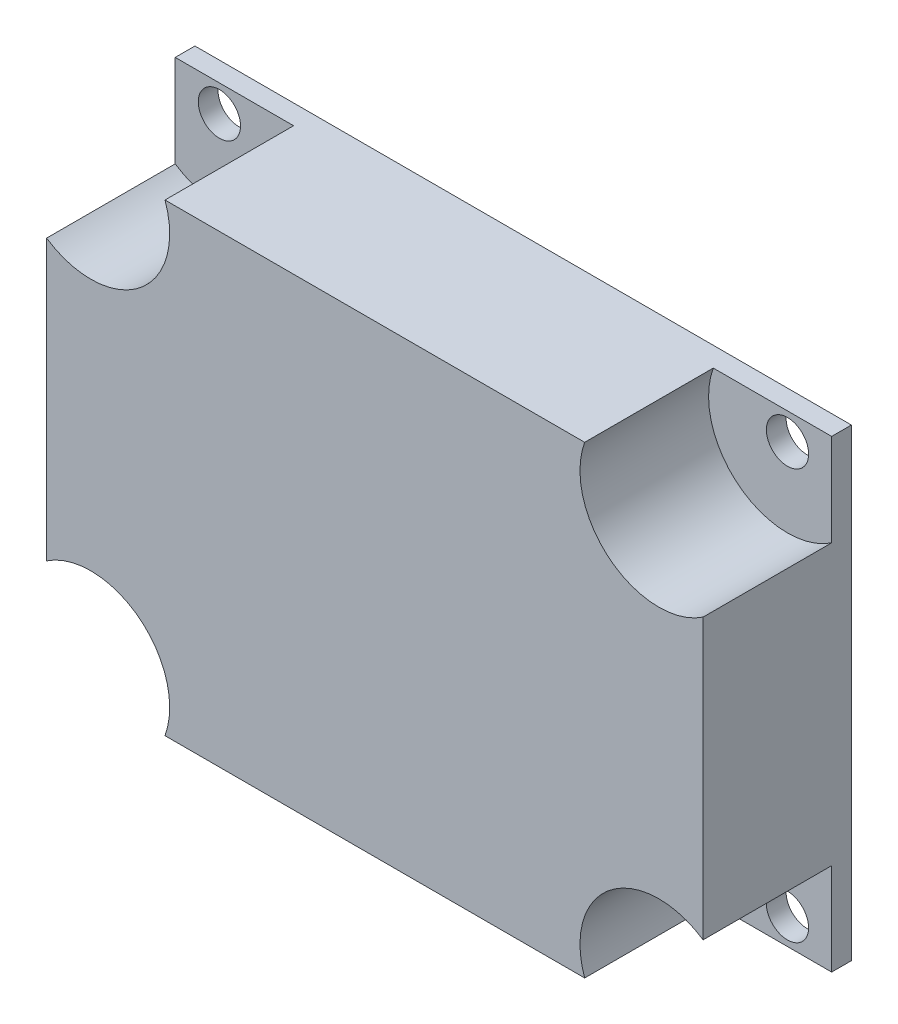
ISO-10303-21;
HEADER;
FILE_DESCRIPTION(('STEP AP214'),'2;1');
FILE_NAME('part.step','',(''),(''),'','','');
FILE_SCHEMA(('AUTOMOTIVE_DESIGN { 1 0 10303 214 1 1 1 1 }'));
ENDSEC;
DATA;
#1=APPLICATION_CONTEXT('core data for automotive mechanical design processes');
#2=APPLICATION_PROTOCOL_DEFINITION('international standard','automotive_design',2000,#1);
#3=PRODUCT_CONTEXT('',#1,'mechanical');
#4=PRODUCT('Part','Part','',(#3));
#5=PRODUCT_RELATED_PRODUCT_CATEGORY('part','',(#4));
#6=PRODUCT_DEFINITION_FORMATION('','',#4);
#7=PRODUCT_DEFINITION_CONTEXT('part definition',#1,'design');
#8=PRODUCT_DEFINITION('design','',#6,#7);
#9=PRODUCT_DEFINITION_SHAPE('','',#8);
#10=(LENGTH_UNIT() NAMED_UNIT(*) SI_UNIT(.MILLI.,.METRE.));
#11=(NAMED_UNIT(*) PLANE_ANGLE_UNIT() SI_UNIT($,.RADIAN.));
#12=(NAMED_UNIT(*) SI_UNIT($,.STERADIAN.) SOLID_ANGLE_UNIT());
#13=UNCERTAINTY_MEASURE_WITH_UNIT(LENGTH_MEASURE(1.E-05),#10,'distance_accuracy_value','');
#14=(GEOMETRIC_REPRESENTATION_CONTEXT(3) GLOBAL_UNCERTAINTY_ASSIGNED_CONTEXT((#13)) GLOBAL_UNIT_ASSIGNED_CONTEXT((#10,
#11,#12)) REPRESENTATION_CONTEXT('',''));
#15=CARTESIAN_POINT('',(0.,0.,0.));
#16=DIRECTION('',(0.,0.,1.));
#17=DIRECTION('',(1.,0.,0.));
#18=AXIS2_PLACEMENT_3D('',#15,#16,#17);
#19=CARTESIAN_POINT('',(-22.86,-16.51,11.938));
#20=DIRECTION('',(0.,0.,1.));
#21=DIRECTION('',(1.,0.,0.));
#22=AXIS2_PLACEMENT_3D('',#19,#20,#21);
#23=CYLINDRICAL_SURFACE('',#22,1.69999999999999);
#24=CARTESIAN_POINT('',(-22.86,-16.51,0.));
#25=DIRECTION('',(0.,0.,1.));
#26=DIRECTION('',(1.,0.,0.));
#27=AXIS2_PLACEMENT_3D('',#24,#25,#26);
#28=CIRCLE('',#27,1.69999999999999);
#29=CARTESIAN_POINT('',(-21.16,-16.51,0.));
#30=VERTEX_POINT('',#29);
#31=EDGE_CURVE('E166',#30,#30,#28,.T.);
#32=ORIENTED_EDGE('',*,*,#31,.F.);
#33=EDGE_LOOP('',(#32));
#34=FACE_BOUND('',#33,.T.);
#35=CARTESIAN_POINT('',(-22.86,-16.51,1.5875));
#36=DIRECTION('',(0.,0.,1.));
#37=DIRECTION('',(1.,0.,0.));
#38=AXIS2_PLACEMENT_3D('',#35,#36,#37);
#39=CIRCLE('',#38,1.69999999999999);
#40=CARTESIAN_POINT('',(-21.16,-16.51,1.5875));
#41=VERTEX_POINT('',#40);
#42=EDGE_CURVE('E39',#41,#41,#39,.F.);
#43=ORIENTED_EDGE('',*,*,#42,.F.);
#44=EDGE_LOOP('',(#43));
#45=FACE_BOUND('',#44,.T.);
#46=ADVANCED_FACE('F35',(#34,#45),#23,.F.);
#47=CARTESIAN_POINT('',(22.86,16.51,11.938));
#48=DIRECTION('',(0.,0.,1.));
#49=DIRECTION('',(1.,0.,0.));
#50=AXIS2_PLACEMENT_3D('',#47,#48,#49);
#51=CYLINDRICAL_SURFACE('',#50,1.69999999999999);
#52=CARTESIAN_POINT('',(22.86,16.51,0.));
#53=DIRECTION('',(0.,0.,1.));
#54=DIRECTION('',(1.,0.,0.));
#55=AXIS2_PLACEMENT_3D('',#52,#53,#54);
#56=CIRCLE('',#55,1.69999999999999);
#57=CARTESIAN_POINT('',(24.56,16.51,0.));
#58=VERTEX_POINT('',#57);
#59=EDGE_CURVE('E227',#58,#58,#56,.T.);
#60=ORIENTED_EDGE('',*,*,#59,.F.);
#61=EDGE_LOOP('',(#60));
#62=FACE_BOUND('',#61,.T.);
#63=CARTESIAN_POINT('',(22.86,16.51,1.5875));
#64=DIRECTION('',(0.,0.,1.));
#65=DIRECTION('',(1.,0.,0.));
#66=AXIS2_PLACEMENT_3D('',#63,#64,#65);
#67=CIRCLE('',#66,1.69999999999999);
#68=CARTESIAN_POINT('',(24.56,16.51,1.5875));
#69=VERTEX_POINT('',#68);
#70=EDGE_CURVE('E185',#69,#69,#67,.F.);
#71=ORIENTED_EDGE('',*,*,#70,.F.);
#72=EDGE_LOOP('',(#71));
#73=FACE_BOUND('',#72,.T.);
#74=ADVANCED_FACE('F237',(#62,#73),#51,.F.);
#75=CARTESIAN_POINT('',(22.86,-16.51,11.938));
#76=DIRECTION('',(0.,0.,1.));
#77=DIRECTION('',(1.,0.,0.));
#78=AXIS2_PLACEMENT_3D('',#75,#76,#77);
#79=CYLINDRICAL_SURFACE('',#78,1.69999999999999);
#80=CARTESIAN_POINT('',(22.86,-16.51,0.));
#81=DIRECTION('',(0.,0.,1.));
#82=DIRECTION('',(1.,0.,0.));
#83=AXIS2_PLACEMENT_3D('',#80,#81,#82);
#84=CIRCLE('',#83,1.69999999999999);
#85=CARTESIAN_POINT('',(24.56,-16.51,0.));
#86=VERTEX_POINT('',#85);
#87=EDGE_CURVE('E224',#86,#86,#84,.T.);
#88=ORIENTED_EDGE('',*,*,#87,.F.);
#89=EDGE_LOOP('',(#88));
#90=FACE_BOUND('',#89,.T.);
#91=CARTESIAN_POINT('',(22.86,-16.51,1.5875));
#92=DIRECTION('',(0.,0.,1.));
#93=DIRECTION('',(1.,0.,0.));
#94=AXIS2_PLACEMENT_3D('',#91,#92,#93);
#95=CIRCLE('',#94,1.69999999999999);
#96=CARTESIAN_POINT('',(24.56,-16.51,1.5875));
#97=VERTEX_POINT('',#96);
#98=EDGE_CURVE('E182',#97,#97,#95,.F.);
#99=ORIENTED_EDGE('',*,*,#98,.F.);
#100=EDGE_LOOP('',(#99));
#101=FACE_BOUND('',#100,.T.);
#102=ADVANCED_FACE('F311',(#90,#101),#79,.F.);
#103=CARTESIAN_POINT('',(-22.86,16.51,11.938));
#104=DIRECTION('',(0.,0.,1.));
#105=DIRECTION('',(1.,0.,0.));
#106=AXIS2_PLACEMENT_3D('',#103,#104,#105);
#107=CYLINDRICAL_SURFACE('',#106,1.69999999999999);
#108=CARTESIAN_POINT('',(-22.86,16.51,0.));
#109=DIRECTION('',(0.,0.,1.));
#110=DIRECTION('',(1.,0.,0.));
#111=AXIS2_PLACEMENT_3D('',#108,#109,#110);
#112=CIRCLE('',#111,1.69999999999999);
#113=CARTESIAN_POINT('',(-21.16,16.51,0.));
#114=VERTEX_POINT('',#113);
#115=EDGE_CURVE('E221',#114,#114,#112,.T.);
#116=ORIENTED_EDGE('',*,*,#115,.F.);
#117=EDGE_LOOP('',(#116));
#118=FACE_BOUND('',#117,.T.);
#119=CARTESIAN_POINT('',(-22.86,16.51,1.5875));
#120=DIRECTION('',(0.,0.,1.));
#121=DIRECTION('',(1.,0.,0.));
#122=AXIS2_PLACEMENT_3D('',#119,#120,#121);
#123=CIRCLE('',#122,1.69999999999999);
#124=CARTESIAN_POINT('',(-21.16,16.51,1.5875));
#125=VERTEX_POINT('',#124);
#126=EDGE_CURVE('E178',#125,#125,#123,.F.);
#127=ORIENTED_EDGE('',*,*,#126,.F.);
#128=EDGE_LOOP('',(#127));
#129=FACE_BOUND('',#128,.T.);
#130=ADVANCED_FACE('F308',(#118,#129),#107,.F.);
#131=CARTESIAN_POINT('',(26.416,18.669,11.938));
#132=DIRECTION('',(-1.,0.,0.));
#133=DIRECTION('',(0.,-1.,0.));
#134=AXIS2_PLACEMENT_3D('',#131,#132,#133);
#135=PLANE('',#134);
#136=DIRECTION('',(0.,1.,0.));
#137=VECTOR('',#136,1.);
#138=CARTESIAN_POINT('',(26.416,18.669,1.5875));
#139=LINE('',#138,#137);
#140=CARTESIAN_POINT('',(26.416,11.2490719449892,1.5875));
#141=VERTEX_POINT('',#140);
#142=CARTESIAN_POINT('',(26.416,18.669,1.5875));
#143=VERTEX_POINT('',#142);
#144=EDGE_CURVE('E191',#141,#143,#139,.T.);
#145=ORIENTED_EDGE('',*,*,#144,.F.);
#146=DIRECTION('',(0.,0.,1.));
#147=VECTOR('',#146,1.);
#148=CARTESIAN_POINT('',(26.416,11.2490719449892,1.5875));
#149=LINE('',#148,#147);
#150=CARTESIAN_POINT('',(26.416,11.2490719449892,11.938));
#151=VERTEX_POINT('',#150);
#152=EDGE_CURVE('E214',#141,#151,#149,.T.);
#153=ORIENTED_EDGE('',*,*,#152,.T.);
#154=DIRECTION('',(0.,1.,0.));
#155=VECTOR('',#154,1.);
#156=CARTESIAN_POINT('',(26.416,18.669,11.938));
#157=LINE('',#156,#155);
#158=CARTESIAN_POINT('',(26.416,-11.2490719449892,11.938));
#159=VERTEX_POINT('',#158);
#160=EDGE_CURVE('E151',#159,#151,#157,.T.);
#161=ORIENTED_EDGE('',*,*,#160,.F.);
#162=DIRECTION('',(0.,0.,1.));
#163=VECTOR('',#162,1.);
#164=CARTESIAN_POINT('',(26.416,-11.2490719449892,1.5875));
#165=LINE('',#164,#163);
#166=CARTESIAN_POINT('',(26.416,-11.2490719449892,1.5875));
#167=VERTEX_POINT('',#166);
#168=EDGE_CURVE('E209',#159,#167,#165,.F.);
#169=ORIENTED_EDGE('',*,*,#168,.T.);
#170=DIRECTION('',(0.,1.,0.));
#171=VECTOR('',#170,1.);
#172=CARTESIAN_POINT('',(26.416,18.669,1.5875));
#173=LINE('',#172,#171);
#174=CARTESIAN_POINT('',(26.416,-18.669,1.5875));
#175=VERTEX_POINT('',#174);
#176=EDGE_CURVE('E188',#175,#167,#173,.T.);
#177=ORIENTED_EDGE('',*,*,#176,.F.);
#178=DIRECTION('',(0.,0.,-1.));
#179=VECTOR('',#178,1.);
#180=CARTESIAN_POINT('',(26.416,-18.669,11.938));
#181=LINE('',#180,#179);
#182=CARTESIAN_POINT('',(26.416,-18.669,0.));
#183=VERTEX_POINT('',#182);
#184=EDGE_CURVE('E161',#175,#183,#181,.T.);
#185=ORIENTED_EDGE('',*,*,#184,.T.);
#186=DIRECTION('',(0.,1.,0.));
#187=VECTOR('',#186,1.);
#188=CARTESIAN_POINT('',(26.416,18.669,0.));
#189=LINE('',#188,#187);
#190=CARTESIAN_POINT('',(26.416,18.669,0.));
#191=VERTEX_POINT('',#190);
#192=EDGE_CURVE('E162',#183,#191,#189,.T.);
#193=ORIENTED_EDGE('',*,*,#192,.T.);
#194=DIRECTION('',(0.,0.,-1.));
#195=VECTOR('',#194,1.);
#196=CARTESIAN_POINT('',(26.416,18.669,11.938));
#197=LINE('',#196,#195);
#198=EDGE_CURVE('E11',#143,#191,#197,.T.);
#199=ORIENTED_EDGE('',*,*,#198,.F.);
#200=EDGE_LOOP('',(#145,#153,#161,#169,#177,#185,#193,#199));
#201=FACE_BOUND('',#200,.T.);
#202=ADVANCED_FACE('F37',(#201),#135,.F.);
#203=CARTESIAN_POINT('',(-26.416,18.669,11.938));
#204=DIRECTION('',(0.,-1.,0.));
#205=DIRECTION('',(0.,0.,-1.));
#206=AXIS2_PLACEMENT_3D('',#203,#204,#205);
#207=PLANE('',#206);
#208=DIRECTION('',(-1.,0.,0.));
#209=VECTOR('',#208,1.);
#210=CARTESIAN_POINT('',(-26.416,18.669,11.938));
#211=LINE('',#210,#209);
#212=CARTESIAN_POINT('',(16.8882984836815,18.669,11.938));
#213=VERTEX_POINT('',#212);
#214=CARTESIAN_POINT('',(-16.8882984836816,18.669,11.938));
#215=VERTEX_POINT('',#214);
#216=EDGE_CURVE('E141',#213,#215,#211,.T.);
#217=ORIENTED_EDGE('',*,*,#216,.F.);
#218=DIRECTION('',(0.,0.,1.));
#219=VECTOR('',#218,1.);
#220=CARTESIAN_POINT('',(16.8882984836815,18.669,1.5875));
#221=LINE('',#220,#219);
#222=CARTESIAN_POINT('',(16.8882984836815,18.669,1.5875));
#223=VERTEX_POINT('',#222);
#224=EDGE_CURVE('E212',#213,#223,#221,.F.);
#225=ORIENTED_EDGE('',*,*,#224,.T.);
#226=DIRECTION('',(-1.,0.,0.));
#227=VECTOR('',#226,1.);
#228=CARTESIAN_POINT('',(-26.416,18.669,1.5875));
#229=LINE('',#228,#227);
#230=EDGE_CURVE('E187',#143,#223,#229,.T.);
#231=ORIENTED_EDGE('',*,*,#230,.F.);
#232=ORIENTED_EDGE('',*,*,#198,.T.);
#233=DIRECTION('',(-1.,0.,0.));
#234=VECTOR('',#233,1.);
#235=CARTESIAN_POINT('',(-26.416,18.669,0.));
#236=LINE('',#235,#234);
#237=CARTESIAN_POINT('',(-26.416,18.669,0.));
#238=VERTEX_POINT('',#237);
#239=EDGE_CURVE('E165',#191,#238,#236,.T.);
#240=ORIENTED_EDGE('',*,*,#239,.T.);
#241=DIRECTION('',(0.,0.,-1.));
#242=VECTOR('',#241,1.);
#243=CARTESIAN_POINT('',(-26.416,18.669,11.938));
#244=LINE('',#243,#242);
#245=CARTESIAN_POINT('',(-26.416,18.669,1.5875));
#246=VERTEX_POINT('',#245);
#247=EDGE_CURVE('E44',#246,#238,#244,.T.);
#248=ORIENTED_EDGE('',*,*,#247,.F.);
#249=DIRECTION('',(-1.,0.,0.));
#250=VECTOR('',#249,1.);
#251=CARTESIAN_POINT('',(-26.416,18.669,1.5875));
#252=LINE('',#251,#250);
#253=CARTESIAN_POINT('',(-16.8882984836816,18.669,1.5875));
#254=VERTEX_POINT('',#253);
#255=EDGE_CURVE('E143',#254,#246,#252,.T.);
#256=ORIENTED_EDGE('',*,*,#255,.F.);
#257=DIRECTION('',(0.,0.,1.));
#258=VECTOR('',#257,1.);
#259=CARTESIAN_POINT('',(-16.8882984836816,18.669,1.5875));
#260=LINE('',#259,#258);
#261=EDGE_CURVE('E127',#254,#215,#260,.T.);
#262=ORIENTED_EDGE('',*,*,#261,.T.);
#263=EDGE_LOOP('',(#217,#225,#231,#232,#240,#248,#256,#262));
#264=FACE_BOUND('',#263,.T.);
#265=ADVANCED_FACE('F139',(#264),#207,.F.);
#266=CARTESIAN_POINT('',(-26.416,18.669,11.938));
#267=DIRECTION('',(1.,0.,0.));
#268=DIRECTION('',(0.,0.,-1.));
#269=AXIS2_PLACEMENT_3D('',#266,#267,#268);
#270=PLANE('',#269);
#271=DIRECTION('',(0.,-1.,0.));
#272=VECTOR('',#271,1.);
#273=CARTESIAN_POINT('',(-26.416,18.669,1.5875));
#274=LINE('',#273,#272);
#275=CARTESIAN_POINT('',(-26.416,-11.2490719449892,1.5875));
#276=VERTEX_POINT('',#275);
#277=CARTESIAN_POINT('',(-26.416,-18.669,1.5875));
#278=VERTEX_POINT('',#277);
#279=EDGE_CURVE('E204',#276,#278,#274,.T.);
#280=ORIENTED_EDGE('',*,*,#279,.F.);
#281=DIRECTION('',(0.,0.,1.));
#282=VECTOR('',#281,1.);
#283=CARTESIAN_POINT('',(-26.416,-11.2490719449892,1.5875));
#284=LINE('',#283,#282);
#285=CARTESIAN_POINT('',(-26.416,-11.2490719449892,11.938));
#286=VERTEX_POINT('',#285);
#287=EDGE_CURVE('E218',#276,#286,#284,.T.);
#288=ORIENTED_EDGE('',*,*,#287,.T.);
#289=DIRECTION('',(0.,-1.,0.));
#290=VECTOR('',#289,1.);
#291=CARTESIAN_POINT('',(-26.416,18.669,11.938));
#292=LINE('',#291,#290);
#293=CARTESIAN_POINT('',(-26.416,11.2490719449892,11.938));
#294=VERTEX_POINT('',#293);
#295=EDGE_CURVE('E150',#294,#286,#292,.T.);
#296=ORIENTED_EDGE('',*,*,#295,.F.);
#297=DIRECTION('',(0.,0.,1.));
#298=VECTOR('',#297,1.);
#299=CARTESIAN_POINT('',(-26.416,11.2490719449892,1.5875));
#300=LINE('',#299,#298);
#301=CARTESIAN_POINT('',(-26.416,11.2490719449892,1.5875));
#302=VERTEX_POINT('',#301);
#303=EDGE_CURVE('E60',#294,#302,#300,.F.);
#304=ORIENTED_EDGE('',*,*,#303,.T.);
#305=DIRECTION('',(0.,-1.,0.));
#306=VECTOR('',#305,1.);
#307=CARTESIAN_POINT('',(-26.416,18.669,1.5875));
#308=LINE('',#307,#306);
#309=EDGE_CURVE('E181',#246,#302,#308,.T.);
#310=ORIENTED_EDGE('',*,*,#309,.F.);
#311=ORIENTED_EDGE('',*,*,#247,.T.);
#312=DIRECTION('',(0.,-1.,0.));
#313=VECTOR('',#312,1.);
#314=CARTESIAN_POINT('',(-26.416,18.669,0.));
#315=LINE('',#314,#313);
#316=CARTESIAN_POINT('',(-26.416,-18.669,0.));
#317=VERTEX_POINT('',#316);
#318=EDGE_CURVE('E169',#238,#317,#315,.T.);
#319=ORIENTED_EDGE('',*,*,#318,.T.);
#320=DIRECTION('',(0.,0.,-1.));
#321=VECTOR('',#320,1.);
#322=CARTESIAN_POINT('',(-26.416,-18.669,11.938));
#323=LINE('',#322,#321);
#324=EDGE_CURVE('E175',#278,#317,#323,.T.);
#325=ORIENTED_EDGE('',*,*,#324,.F.);
#326=EDGE_LOOP('',(#280,#288,#296,#304,#310,#311,#319,#325));
#327=FACE_BOUND('',#326,.T.);
#328=ADVANCED_FACE('F255',(#327),#270,.F.);
#329=CARTESIAN_POINT('',(-26.416,-18.669,11.938));
#330=DIRECTION('',(0.,1.,0.));
#331=DIRECTION('',(0.,0.,1.));
#332=AXIS2_PLACEMENT_3D('',#329,#330,#331);
#333=PLANE('',#332);
#334=DIRECTION('',(1.,0.,0.));
#335=VECTOR('',#334,1.);
#336=CARTESIAN_POINT('',(-26.416,-18.669,11.938));
#337=LINE('',#336,#335);
#338=CARTESIAN_POINT('',(-16.8882984836816,-18.669,11.938));
#339=VERTEX_POINT('',#338);
#340=CARTESIAN_POINT('',(16.8882984836815,-18.669,11.938));
#341=VERTEX_POINT('',#340);
#342=EDGE_CURVE('E153',#339,#341,#337,.T.);
#343=ORIENTED_EDGE('',*,*,#342,.F.);
#344=DIRECTION('',(0.,0.,1.));
#345=VECTOR('',#344,1.);
#346=CARTESIAN_POINT('',(-16.8882984836816,-18.669,1.5875));
#347=LINE('',#346,#345);
#348=CARTESIAN_POINT('',(-16.8882984836816,-18.669,1.5875));
#349=VERTEX_POINT('',#348);
#350=EDGE_CURVE('E52',#339,#349,#347,.F.);
#351=ORIENTED_EDGE('',*,*,#350,.T.);
#352=DIRECTION('',(1.,0.,0.));
#353=VECTOR('',#352,1.);
#354=CARTESIAN_POINT('',(-26.416,-18.669,1.5875));
#355=LINE('',#354,#353);
#356=EDGE_CURVE('E202',#278,#349,#355,.T.);
#357=ORIENTED_EDGE('',*,*,#356,.F.);
#358=ORIENTED_EDGE('',*,*,#324,.T.);
#359=DIRECTION('',(1.,0.,0.));
#360=VECTOR('',#359,1.);
#361=CARTESIAN_POINT('',(-26.416,-18.669,0.));
#362=LINE('',#361,#360);
#363=EDGE_CURVE('E155',#317,#183,#362,.T.);
#364=ORIENTED_EDGE('',*,*,#363,.T.);
#365=ORIENTED_EDGE('',*,*,#184,.F.);
#366=DIRECTION('',(1.,0.,0.));
#367=VECTOR('',#366,1.);
#368=CARTESIAN_POINT('',(-26.416,-18.669,1.5875));
#369=LINE('',#368,#367);
#370=CARTESIAN_POINT('',(16.8882984836815,-18.669,1.5875));
#371=VERTEX_POINT('',#370);
#372=EDGE_CURVE('E184',#371,#175,#369,.T.);
#373=ORIENTED_EDGE('',*,*,#372,.F.);
#374=DIRECTION('',(0.,0.,1.));
#375=VECTOR('',#374,1.);
#376=CARTESIAN_POINT('',(16.8882984836815,-18.669,1.5875));
#377=LINE('',#376,#375);
#378=EDGE_CURVE('E144',#371,#341,#377,.T.);
#379=ORIENTED_EDGE('',*,*,#378,.T.);
#380=EDGE_LOOP('',(#343,#351,#357,#358,#364,#365,#373,#379));
#381=FACE_BOUND('',#380,.T.);
#382=ADVANCED_FACE('F254',(#381),#333,.F.);
#383=CARTESIAN_POINT('',(0.,0.,11.938));
#384=DIRECTION('',(0.,0.,1.));
#385=DIRECTION('',(1.,0.,0.));
#386=AXIS2_PLACEMENT_3D('',#383,#384,#385);
#387=PLANE('',#386);
#388=CARTESIAN_POINT('',(-22.86,-16.51,11.938));
#389=DIRECTION('',(0.,0.,1.));
#390=DIRECTION('',(1.,0.,0.));
#391=AXIS2_PLACEMENT_3D('',#388,#389,#390);
#392=CIRCLE('',#391,6.35);
#393=EDGE_CURVE('E276',#339,#286,#392,.T.);
#394=ORIENTED_EDGE('',*,*,#393,.F.);
#395=ORIENTED_EDGE('',*,*,#342,.T.);
#396=CARTESIAN_POINT('',(22.86,-16.51,11.938));
#397=DIRECTION('',(0.,0.,1.));
#398=DIRECTION('',(1.,0.,0.));
#399=AXIS2_PLACEMENT_3D('',#396,#397,#398);
#400=CIRCLE('',#399,6.35);
#401=EDGE_CURVE('E270',#159,#341,#400,.T.);
#402=ORIENTED_EDGE('',*,*,#401,.F.);
#403=ORIENTED_EDGE('',*,*,#160,.T.);
#404=CARTESIAN_POINT('',(22.86,16.51,11.938));
#405=DIRECTION('',(0.,0.,1.));
#406=DIRECTION('',(1.,0.,0.));
#407=AXIS2_PLACEMENT_3D('',#404,#405,#406);
#408=CIRCLE('',#407,6.35);
#409=EDGE_CURVE('E149',#213,#151,#408,.T.);
#410=ORIENTED_EDGE('',*,*,#409,.F.);
#411=ORIENTED_EDGE('',*,*,#216,.T.);
#412=CARTESIAN_POINT('',(-22.86,16.51,11.938));
#413=DIRECTION('',(0.,0.,1.));
#414=DIRECTION('',(1.,0.,0.));
#415=AXIS2_PLACEMENT_3D('',#412,#413,#414);
#416=CIRCLE('',#415,6.35);
#417=EDGE_CURVE('E124',#294,#215,#416,.T.);
#418=ORIENTED_EDGE('',*,*,#417,.F.);
#419=ORIENTED_EDGE('',*,*,#295,.T.);
#420=EDGE_LOOP('',(#394,#395,#402,#403,#410,#411,#418,#419));
#421=FACE_BOUND('',#420,.T.);
#422=ADVANCED_FACE('F147',(#421),#387,.T.);
#423=CARTESIAN_POINT('',(0.,0.,0.));
#424=DIRECTION('',(0.,0.,1.));
#425=DIRECTION('',(1.,0.,0.));
#426=AXIS2_PLACEMENT_3D('',#423,#424,#425);
#427=PLANE('',#426);
#428=ORIENTED_EDGE('',*,*,#115,.T.);
#429=EDGE_LOOP('',(#428));
#430=FACE_BOUND('',#429,.T.);
#431=ORIENTED_EDGE('',*,*,#87,.T.);
#432=EDGE_LOOP('',(#431));
#433=FACE_BOUND('',#432,.T.);
#434=ORIENTED_EDGE('',*,*,#59,.T.);
#435=EDGE_LOOP('',(#434));
#436=FACE_BOUND('',#435,.T.);
#437=ORIENTED_EDGE('',*,*,#31,.T.);
#438=EDGE_LOOP('',(#437));
#439=FACE_BOUND('',#438,.T.);
#440=ORIENTED_EDGE('',*,*,#192,.F.);
#441=ORIENTED_EDGE('',*,*,#363,.F.);
#442=ORIENTED_EDGE('',*,*,#318,.F.);
#443=ORIENTED_EDGE('',*,*,#239,.F.);
#444=EDGE_LOOP('',(#440,#441,#442,#443));
#445=FACE_BOUND('',#444,.T.);
#446=ADVANCED_FACE('F232',(#430,#433,#436,#439,#445),#427,.F.);
#447=CARTESIAN_POINT('',(-22.86,16.51,1.5875));
#448=DIRECTION('',(0.,0.,1.));
#449=DIRECTION('',(1.,0.,0.));
#450=AXIS2_PLACEMENT_3D('',#447,#448,#449);
#451=CYLINDRICAL_SURFACE('',#450,6.35);
#452=CARTESIAN_POINT('',(-22.86,16.51,1.5875));
#453=DIRECTION('',(0.,0.,1.));
#454=DIRECTION('',(1.,0.,0.));
#455=AXIS2_PLACEMENT_3D('',#452,#453,#454);
#456=CIRCLE('',#455,6.35);
#457=EDGE_CURVE('E133',#302,#254,#456,.T.);
#458=ORIENTED_EDGE('',*,*,#457,.F.);
#459=ORIENTED_EDGE('',*,*,#303,.F.);
#460=ORIENTED_EDGE('',*,*,#417,.T.);
#461=ORIENTED_EDGE('',*,*,#261,.F.);
#462=EDGE_LOOP('',(#458,#459,#460,#461));
#463=FACE_BOUND('',#462,.T.);
#464=ADVANCED_FACE('F126',(#463),#451,.F.);
#465=CARTESIAN_POINT('',(-22.86,16.51,1.5875));
#466=DIRECTION('',(0.,0.,1.));
#467=DIRECTION('',(1.,0.,0.));
#468=AXIS2_PLACEMENT_3D('',#465,#466,#467);
#469=PLANE('',#468);
#470=ORIENTED_EDGE('',*,*,#126,.T.);
#471=EDGE_LOOP('',(#470));
#472=FACE_BOUND('',#471,.T.);
#473=ORIENTED_EDGE('',*,*,#255,.T.);
#474=ORIENTED_EDGE('',*,*,#309,.T.);
#475=ORIENTED_EDGE('',*,*,#457,.T.);
#476=EDGE_LOOP('',(#473,#474,#475));
#477=FACE_BOUND('',#476,.T.);
#478=ADVANCED_FACE('F284',(#472,#477),#469,.T.);
#479=CARTESIAN_POINT('',(22.86,-16.51,1.5875));
#480=DIRECTION('',(0.,0.,1.));
#481=DIRECTION('',(1.,0.,0.));
#482=AXIS2_PLACEMENT_3D('',#479,#480,#481);
#483=CYLINDRICAL_SURFACE('',#482,6.35);
#484=ORIENTED_EDGE('',*,*,#401,.T.);
#485=ORIENTED_EDGE('',*,*,#378,.F.);
#486=CARTESIAN_POINT('',(22.86,-16.51,1.5875));
#487=DIRECTION('',(0.,0.,1.));
#488=DIRECTION('',(1.,0.,0.));
#489=AXIS2_PLACEMENT_3D('',#486,#487,#488);
#490=CIRCLE('',#489,6.35);
#491=EDGE_CURVE('E271',#167,#371,#490,.T.);
#492=ORIENTED_EDGE('',*,*,#491,.F.);
#493=ORIENTED_EDGE('',*,*,#168,.F.);
#494=EDGE_LOOP('',(#484,#485,#492,#493));
#495=FACE_BOUND('',#494,.T.);
#496=ADVANCED_FACE('F269',(#495),#483,.F.);
#497=CARTESIAN_POINT('',(22.86,-16.51,1.5875));
#498=DIRECTION('',(0.,0.,1.));
#499=DIRECTION('',(1.,0.,0.));
#500=AXIS2_PLACEMENT_3D('',#497,#498,#499);
#501=PLANE('',#500);
#502=ORIENTED_EDGE('',*,*,#98,.T.);
#503=EDGE_LOOP('',(#502));
#504=FACE_BOUND('',#503,.T.);
#505=ORIENTED_EDGE('',*,*,#176,.T.);
#506=ORIENTED_EDGE('',*,*,#491,.T.);
#507=ORIENTED_EDGE('',*,*,#372,.T.);
#508=EDGE_LOOP('',(#505,#506,#507));
#509=FACE_BOUND('',#508,.T.);
#510=ADVANCED_FACE('F292',(#504,#509),#501,.T.);
#511=CARTESIAN_POINT('',(22.86,16.51,1.5875));
#512=DIRECTION('',(0.,0.,1.));
#513=DIRECTION('',(1.,0.,0.));
#514=AXIS2_PLACEMENT_3D('',#511,#512,#513);
#515=CYLINDRICAL_SURFACE('',#514,6.35);
#516=CARTESIAN_POINT('',(22.86,16.51,1.5875));
#517=DIRECTION('',(0.,0.,1.));
#518=DIRECTION('',(1.,0.,0.));
#519=AXIS2_PLACEMENT_3D('',#516,#517,#518);
#520=CIRCLE('',#519,6.35);
#521=EDGE_CURVE('E278',#223,#141,#520,.T.);
#522=ORIENTED_EDGE('',*,*,#521,.F.);
#523=ORIENTED_EDGE('',*,*,#224,.F.);
#524=ORIENTED_EDGE('',*,*,#409,.T.);
#525=ORIENTED_EDGE('',*,*,#152,.F.);
#526=EDGE_LOOP('',(#522,#523,#524,#525));
#527=FACE_BOUND('',#526,.T.);
#528=ADVANCED_FACE('F290',(#527),#515,.F.);
#529=CARTESIAN_POINT('',(22.86,16.51,1.5875));
#530=DIRECTION('',(0.,0.,1.));
#531=DIRECTION('',(1.,0.,0.));
#532=AXIS2_PLACEMENT_3D('',#529,#530,#531);
#533=PLANE('',#532);
#534=ORIENTED_EDGE('',*,*,#70,.T.);
#535=EDGE_LOOP('',(#534));
#536=FACE_BOUND('',#535,.T.);
#537=ORIENTED_EDGE('',*,*,#144,.T.);
#538=ORIENTED_EDGE('',*,*,#230,.T.);
#539=ORIENTED_EDGE('',*,*,#521,.T.);
#540=EDGE_LOOP('',(#537,#538,#539));
#541=FACE_BOUND('',#540,.T.);
#542=ADVANCED_FACE('F287',(#536,#541),#533,.T.);
#543=CARTESIAN_POINT('',(-22.86,-16.51,1.5875));
#544=DIRECTION('',(0.,0.,1.));
#545=DIRECTION('',(1.,0.,0.));
#546=AXIS2_PLACEMENT_3D('',#543,#544,#545);
#547=CYLINDRICAL_SURFACE('',#546,6.35);
#548=CARTESIAN_POINT('',(-22.86,-16.51,1.5875));
#549=DIRECTION('',(0.,0.,1.));
#550=DIRECTION('',(1.,0.,0.));
#551=AXIS2_PLACEMENT_3D('',#548,#549,#550);
#552=CIRCLE('',#551,6.35);
#553=EDGE_CURVE('E134',#349,#276,#552,.T.);
#554=ORIENTED_EDGE('',*,*,#553,.F.);
#555=ORIENTED_EDGE('',*,*,#350,.F.);
#556=ORIENTED_EDGE('',*,*,#393,.T.);
#557=ORIENTED_EDGE('',*,*,#287,.F.);
#558=EDGE_LOOP('',(#554,#555,#556,#557));
#559=FACE_BOUND('',#558,.T.);
#560=ADVANCED_FACE('F245',(#559),#547,.F.);
#561=CARTESIAN_POINT('',(-22.86,-16.51,1.5875));
#562=DIRECTION('',(0.,0.,1.));
#563=DIRECTION('',(1.,0.,0.));
#564=AXIS2_PLACEMENT_3D('',#561,#562,#563);
#565=PLANE('',#564);
#566=ORIENTED_EDGE('',*,*,#42,.T.);
#567=EDGE_LOOP('',(#566));
#568=FACE_BOUND('',#567,.T.);
#569=ORIENTED_EDGE('',*,*,#279,.T.);
#570=ORIENTED_EDGE('',*,*,#356,.T.);
#571=ORIENTED_EDGE('',*,*,#553,.T.);
#572=EDGE_LOOP('',(#569,#570,#571));
#573=FACE_BOUND('',#572,.T.);
#574=ADVANCED_FACE('F242',(#568,#573),#565,.T.);
#575=CLOSED_SHELL('',(#46,#74,#102,#130,#202,#265,#328,#382,#422,#446,#464,#478,#496,#510,#528,
#542,#560,#574));
#576=MANIFOLD_SOLID_BREP('B2',#575);
#577=ADVANCED_BREP_SHAPE_REPRESENTATION('',(#18,#576),#14);
#578=SHAPE_DEFINITION_REPRESENTATION(#9,#577);
ENDSEC;
END-ISO-10303-21;
